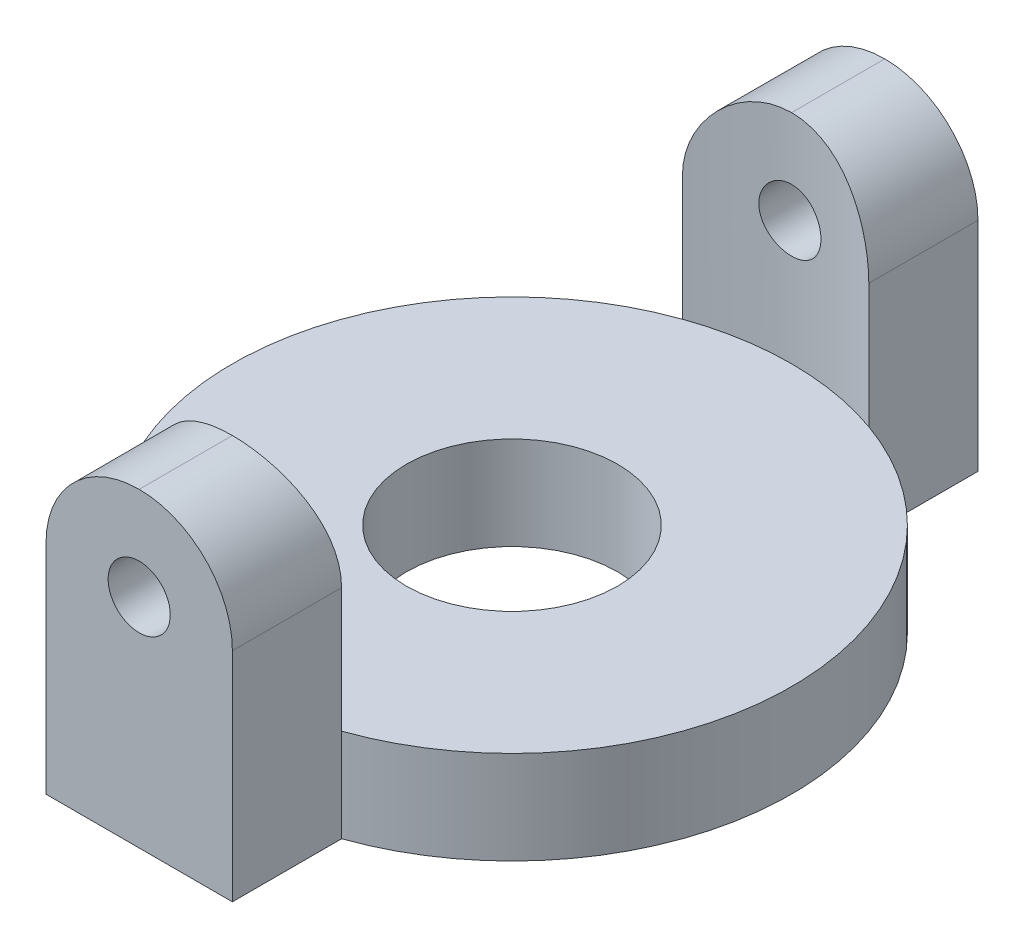
ISO-10303-21;
HEADER;
FILE_DESCRIPTION(('STEP AP214'),'2;1');
FILE_NAME('part.step','',(''),(''),'','','');
FILE_SCHEMA(('AUTOMOTIVE_DESIGN { 1 0 10303 214 1 1 1 1 }'));
ENDSEC;
DATA;
#1=APPLICATION_CONTEXT('core data for automotive mechanical design processes');
#2=APPLICATION_PROTOCOL_DEFINITION('international standard','automotive_design',2000,#1);
#3=PRODUCT_CONTEXT('',#1,'mechanical');
#4=PRODUCT('Part','Part','',(#3));
#5=PRODUCT_RELATED_PRODUCT_CATEGORY('part','',(#4));
#6=PRODUCT_DEFINITION_FORMATION('','',#4);
#7=PRODUCT_DEFINITION_CONTEXT('part definition',#1,'design');
#8=PRODUCT_DEFINITION('design','',#6,#7);
#9=PRODUCT_DEFINITION_SHAPE('','',#8);
#10=(LENGTH_UNIT() NAMED_UNIT(*) SI_UNIT(.MILLI.,.METRE.));
#11=(NAMED_UNIT(*) PLANE_ANGLE_UNIT() SI_UNIT($,.RADIAN.));
#12=(NAMED_UNIT(*) SI_UNIT($,.STERADIAN.) SOLID_ANGLE_UNIT());
#13=UNCERTAINTY_MEASURE_WITH_UNIT(LENGTH_MEASURE(1.E-05),#10,'distance_accuracy_value','');
#14=(GEOMETRIC_REPRESENTATION_CONTEXT(3) GLOBAL_UNCERTAINTY_ASSIGNED_CONTEXT((#13)) GLOBAL_UNIT_ASSIGNED_CONTEXT((#10,
#11,#12)) REPRESENTATION_CONTEXT('',''));
#15=CARTESIAN_POINT('',(0.,0.,0.));
#16=DIRECTION('',(0.,0.,1.));
#17=DIRECTION('',(1.,0.,0.));
#18=AXIS2_PLACEMENT_3D('',#15,#16,#17);
#19=CARTESIAN_POINT('',(0.,1.5,0.));
#20=DIRECTION('',(0.,-1.,0.));
#21=DIRECTION('',(0.,0.,-1.));
#22=AXIS2_PLACEMENT_3D('',#19,#20,#21);
#23=CYLINDRICAL_SURFACE('',#22,4.5);
#24=DIRECTION('',(0.,-1.,0.));
#25=VECTOR('',#24,1.);
#26=CARTESIAN_POINT('',(-1.5,5.,-4.24264068711928));
#27=LINE('',#26,#25);
#28=CARTESIAN_POINT('',(-1.5,1.5,-4.24264068711928));
#29=VERTEX_POINT('',#28);
#30=CARTESIAN_POINT('',(-1.5,0.,-4.24264068711928));
#31=VERTEX_POINT('',#30);
#32=EDGE_CURVE('E141',#29,#31,#27,.T.);
#33=ORIENTED_EDGE('',*,*,#32,.T.);
#34=CARTESIAN_POINT('',(0.,0.,0.));
#35=DIRECTION('',(0.,1.,0.));
#36=DIRECTION('',(0.,0.,1.));
#37=AXIS2_PLACEMENT_3D('',#34,#35,#36);
#38=CIRCLE('',#37,4.5);
#39=CARTESIAN_POINT('',(-1.5,0.,4.24264068711929));
#40=VERTEX_POINT('',#39);
#41=EDGE_CURVE('E123',#31,#40,#38,.T.);
#42=ORIENTED_EDGE('',*,*,#41,.T.);
#43=DIRECTION('',(0.,-1.,0.));
#44=VECTOR('',#43,1.);
#45=CARTESIAN_POINT('',(-1.5,1.5,4.24264068711929));
#46=LINE('',#45,#44);
#47=CARTESIAN_POINT('',(-1.5,1.5,4.24264068711928));
#48=VERTEX_POINT('',#47);
#49=EDGE_CURVE('E198',#48,#40,#46,.T.);
#50=ORIENTED_EDGE('',*,*,#49,.F.);
#51=CARTESIAN_POINT('',(0.,1.5,0.));
#52=DIRECTION('',(0.,1.,0.));
#53=DIRECTION('',(0.,0.,1.));
#54=AXIS2_PLACEMENT_3D('',#51,#52,#53);
#55=CIRCLE('',#54,4.5);
#56=EDGE_CURVE('E143',#29,#48,#55,.T.);
#57=ORIENTED_EDGE('',*,*,#56,.F.);
#58=EDGE_LOOP('',(#33,#42,#50,#57));
#59=FACE_BOUND('',#58,.T.);
#60=ADVANCED_FACE('F35',(#59),#23,.T.);
#61=DIRECTION('',(0.,-1.,0.));
#62=VECTOR('',#61,1.);
#63=CARTESIAN_POINT('',(1.5,5.,-4.24264068711929));
#64=LINE('',#63,#62);
#65=CARTESIAN_POINT('',(1.5,1.5,-4.24264068711928));
#66=VERTEX_POINT('',#65);
#67=CARTESIAN_POINT('',(1.5,0.,-4.24264068711928));
#68=VERTEX_POINT('',#67);
#69=EDGE_CURVE('E172',#66,#68,#64,.T.);
#70=ORIENTED_EDGE('',*,*,#69,.F.);
#71=CARTESIAN_POINT('',(1.5,1.5,4.24264068711928));
#72=VERTEX_POINT('',#71);
#73=EDGE_CURVE('E196',#72,#66,#55,.T.);
#74=ORIENTED_EDGE('',*,*,#73,.F.);
#75=DIRECTION('',(0.,-1.,0.));
#76=VECTOR('',#75,1.);
#77=CARTESIAN_POINT('',(1.5,1.5,4.24264068711928));
#78=LINE('',#77,#76);
#79=CARTESIAN_POINT('',(1.5,0.,4.24264068711929));
#80=VERTEX_POINT('',#79);
#81=EDGE_CURVE('E202',#80,#72,#78,.F.);
#82=ORIENTED_EDGE('',*,*,#81,.F.);
#83=EDGE_CURVE('E136',#80,#68,#38,.T.);
#84=ORIENTED_EDGE('',*,*,#83,.T.);
#85=EDGE_LOOP('',(#70,#74,#82,#84));
#86=FACE_BOUND('',#85,.T.);
#87=ADVANCED_FACE('F240',(#86),#23,.T.);
#88=CARTESIAN_POINT('',(0.,1.5,0.));
#89=DIRECTION('',(0.,1.,0.));
#90=DIRECTION('',(0.,0.,1.));
#91=AXIS2_PLACEMENT_3D('',#88,#89,#90);
#92=PLANE('',#91);
#93=ORIENTED_EDGE('',*,*,#73,.T.);
#94=CARTESIAN_POINT('',(0.,1.5,0.));
#95=DIRECTION('',(0.,1.,0.));
#96=DIRECTION('',(0.,0.,1.));
#97=AXIS2_PLACEMENT_3D('',#94,#95,#96);
#98=CIRCLE('',#97,4.5);
#99=EDGE_CURVE('E174',#66,#29,#98,.T.);
#100=ORIENTED_EDGE('',*,*,#99,.T.);
#101=ORIENTED_EDGE('',*,*,#56,.T.);
#102=EDGE_CURVE('E199',#48,#72,#55,.T.);
#103=ORIENTED_EDGE('',*,*,#102,.T.);
#104=EDGE_LOOP('',(#93,#100,#101,#103));
#105=FACE_BOUND('',#104,.T.);
#106=CARTESIAN_POINT('',(0.,1.5,0.));
#107=DIRECTION('',(0.,1.,0.));
#108=DIRECTION('',(0.,0.,1.));
#109=AXIS2_PLACEMENT_3D('',#106,#107,#108);
#110=CIRCLE('',#109,1.7);
#111=CARTESIAN_POINT('',(0.,1.5,1.7));
#112=VERTEX_POINT('',#111);
#113=EDGE_CURVE('E137',#112,#112,#110,.T.);
#114=ORIENTED_EDGE('',*,*,#113,.F.);
#115=EDGE_LOOP('',(#114));
#116=FACE_BOUND('',#115,.T.);
#117=ADVANCED_FACE('F237',(#105,#116),#92,.T.);
#118=CARTESIAN_POINT('',(0.,0.,0.));
#119=DIRECTION('',(0.,1.,0.));
#120=DIRECTION('',(0.,0.,1.));
#121=AXIS2_PLACEMENT_3D('',#118,#119,#120);
#122=PLANE('',#121);
#123=ORIENTED_EDGE('',*,*,#83,.F.);
#124=DIRECTION('',(0.,0.,-1.));
#125=VECTOR('',#124,1.);
#126=CARTESIAN_POINT('',(1.5,0.,4.24264068711929));
#127=LINE('',#126,#125);
#128=CARTESIAN_POINT('',(1.5,0.,5.99999999999999));
#129=VERTEX_POINT('',#128);
#130=EDGE_CURVE('E176',#129,#80,#127,.T.);
#131=ORIENTED_EDGE('',*,*,#130,.F.);
#132=DIRECTION('',(1.,0.,0.));
#133=VECTOR('',#132,1.);
#134=CARTESIAN_POINT('',(-1.5,0.,5.99999999999999));
#135=LINE('',#134,#133);
#136=CARTESIAN_POINT('',(-1.5,0.,5.99999999999999));
#137=VERTEX_POINT('',#136);
#138=EDGE_CURVE('E180',#137,#129,#135,.T.);
#139=ORIENTED_EDGE('',*,*,#138,.F.);
#140=DIRECTION('',(0.,0.,1.));
#141=VECTOR('',#140,1.);
#142=CARTESIAN_POINT('',(-1.5,0.,4.24264068711928));
#143=LINE('',#142,#141);
#144=EDGE_CURVE('E132',#40,#137,#143,.T.);
#145=ORIENTED_EDGE('',*,*,#144,.F.);
#146=ORIENTED_EDGE('',*,*,#41,.F.);
#147=DIRECTION('',(0.,0.,1.));
#148=VECTOR('',#147,1.);
#149=CARTESIAN_POINT('',(-1.5,0.,-6.));
#150=LINE('',#149,#148);
#151=CARTESIAN_POINT('',(-1.5,0.,-6.));
#152=VERTEX_POINT('',#151);
#153=EDGE_CURVE('E129',#152,#31,#150,.T.);
#154=ORIENTED_EDGE('',*,*,#153,.F.);
#155=DIRECTION('',(-1.,0.,0.));
#156=VECTOR('',#155,1.);
#157=CARTESIAN_POINT('',(-1.5,0.,-6.));
#158=LINE('',#157,#156);
#159=CARTESIAN_POINT('',(1.5,0.,-6.));
#160=VERTEX_POINT('',#159);
#161=EDGE_CURVE('E157',#160,#152,#158,.T.);
#162=ORIENTED_EDGE('',*,*,#161,.F.);
#163=DIRECTION('',(0.,0.,-1.));
#164=VECTOR('',#163,1.);
#165=CARTESIAN_POINT('',(1.5,0.,-6.));
#166=LINE('',#165,#164);
#167=EDGE_CURVE('E153',#68,#160,#166,.T.);
#168=ORIENTED_EDGE('',*,*,#167,.F.);
#169=EDGE_LOOP('',(#123,#131,#139,#145,#146,#154,#162,#168));
#170=FACE_BOUND('',#169,.T.);
#171=CARTESIAN_POINT('',(0.,0.,0.));
#172=DIRECTION('',(0.,1.,0.));
#173=DIRECTION('',(0.,0.,1.));
#174=AXIS2_PLACEMENT_3D('',#171,#172,#173);
#175=CIRCLE('',#174,1.7);
#176=CARTESIAN_POINT('',(0.,0.,1.7));
#177=VERTEX_POINT('',#176);
#178=EDGE_CURVE('E191',#177,#177,#175,.T.);
#179=ORIENTED_EDGE('',*,*,#178,.T.);
#180=EDGE_LOOP('',(#179));
#181=FACE_BOUND('',#180,.T.);
#182=ADVANCED_FACE('F125',(#170,#181),#122,.F.);
#183=CARTESIAN_POINT('',(0.,1.5,0.));
#184=DIRECTION('',(0.,-1.,0.));
#185=DIRECTION('',(0.,0.,-1.));
#186=AXIS2_PLACEMENT_3D('',#183,#184,#185);
#187=CYLINDRICAL_SURFACE('',#186,1.7);
#188=ORIENTED_EDGE('',*,*,#113,.T.);
#189=EDGE_LOOP('',(#188));
#190=FACE_BOUND('',#189,.T.);
#191=ORIENTED_EDGE('',*,*,#178,.F.);
#192=EDGE_LOOP('',(#191));
#193=FACE_BOUND('',#192,.T.);
#194=ADVANCED_FACE('F232',(#190,#193),#187,.F.);
#195=CARTESIAN_POINT('',(1.5,5.,4.24264068711929));
#196=DIRECTION('',(-1.,0.,0.));
#197=DIRECTION('',(0.,0.,1.));
#198=AXIS2_PLACEMENT_3D('',#195,#196,#197);
#199=PLANE('',#198);
#200=DIRECTION('',(0.,-1.,0.));
#201=VECTOR('',#200,1.);
#202=CARTESIAN_POINT('',(1.5,5.,4.24264068711929));
#203=LINE('',#202,#201);
#204=CARTESIAN_POINT('',(1.5,3.5,4.24264068711929));
#205=VERTEX_POINT('',#204);
#206=EDGE_CURVE('E189',#205,#72,#203,.T.);
#207=ORIENTED_EDGE('',*,*,#206,.F.);
#208=DIRECTION('',(0.,0.,-1.));
#209=VECTOR('',#208,1.);
#210=CARTESIAN_POINT('',(1.5,3.5,5.99999999999999));
#211=LINE('',#210,#209);
#212=CARTESIAN_POINT('',(1.5,3.5,5.99999999999999));
#213=VERTEX_POINT('',#212);
#214=EDGE_CURVE('E262',#205,#213,#211,.F.);
#215=ORIENTED_EDGE('',*,*,#214,.T.);
#216=DIRECTION('',(0.,-1.,0.));
#217=VECTOR('',#216,1.);
#218=CARTESIAN_POINT('',(1.5,5.,5.99999999999999));
#219=LINE('',#218,#217);
#220=EDGE_CURVE('E183',#213,#129,#219,.T.);
#221=ORIENTED_EDGE('',*,*,#220,.T.);
#222=ORIENTED_EDGE('',*,*,#130,.T.);
#223=ORIENTED_EDGE('',*,*,#81,.T.);
#224=EDGE_LOOP('',(#207,#215,#221,#222,#223));
#225=FACE_BOUND('',#224,.T.);
#226=ADVANCED_FACE('F225',(#225),#199,.F.);
#227=CARTESIAN_POINT('',(0.,5.,0.));
#228=DIRECTION('',(0.,-1.,0.));
#229=DIRECTION('',(0.,0.,-1.));
#230=AXIS2_PLACEMENT_3D('',#227,#228,#229);
#231=CYLINDRICAL_SURFACE('',#230,4.5);
#232=CARTESIAN_POINT('',(0.5,3.5,4.47213595499958));
#233=CARTESIAN_POINT('',(0.499998796258938,3.52799205673855,4.47213631683783));
#234=CARTESIAN_POINT('',(0.497641411056238,3.55600219988225,4.47240160207655));
#235=CARTESIAN_POINT('',(0.488273639283176,3.61124467202846,4.47343382673447));
#236=CARTESIAN_POINT('',(0.481258235719832,3.63847612931242,4.47420130703794));
#237=CARTESIAN_POINT('',(0.462782304707468,3.69135330951255,4.47614994074426));
#238=CARTESIAN_POINT('',(0.451324606357619,3.71700002964918,4.47733083081853));
#239=CARTESIAN_POINT('',(0.424295034963049,3.76600125782328,4.47997290658838));
#240=CARTESIAN_POINT('',(0.408723931403472,3.78935619346004,4.48143403984552));
#241=CARTESIAN_POINT('',(0.373835165529888,3.83322012454534,4.48447925761171));
#242=CARTESIAN_POINT('',(0.354502878465011,3.85371745658957,4.48606380709555));
#243=CARTESIAN_POINT('',(0.31267189050312,3.89118376347665,4.4891731161395));
#244=CARTESIAN_POINT('',(0.290173039634354,3.90815257111055,4.49069787286338));
#245=CARTESIAN_POINT('',(0.242575243977716,3.93812118565091,4.49352047185626));
#246=CARTESIAN_POINT('',(0.217469691565487,3.9511105593084,4.49481771389023));
#247=CARTESIAN_POINT('',(0.165416867879499,3.97268480904972,4.49703403548833));
#248=CARTESIAN_POINT('',(0.138469651283893,3.98126981583283,4.49795312627391));
#249=CARTESIAN_POINT('',(0.0836170021554739,3.99375712330544,4.49930631949627));
#250=CARTESIAN_POINT('',(0.0557160073898263,3.99767869794708,4.4997424176232));
#251=CARTESIAN_POINT('',(-0.000351281196377822,4.00078749932574,4.50008728893842));
#252=CARTESIAN_POINT('',(-0.028517566623086,3.99997487535469,4.49999607875526));
#253=CARTESIAN_POINT('',(-0.0841849364698929,3.99365390880449,4.4992982357037));
#254=CARTESIAN_POINT('',(-0.11168840686845,3.98816629266205,4.49869387789913));
#255=CARTESIAN_POINT('',(-0.165381568624666,3.97268345036826,4.49704023493393));
#256=CARTESIAN_POINT('',(-0.191571239534311,3.96268815408341,4.49599094285074));
#257=CARTESIAN_POINT('',(-0.241958219879531,3.93845124219583,4.49356144944717));
#258=CARTESIAN_POINT('',(-0.266151122779296,3.92420053942206,4.49218054122816));
#259=CARTESIAN_POINT('',(-0.311809742357699,3.89186394232829,4.48924257756286));
#260=CARTESIAN_POINT('',(-0.333275360149761,3.87377790900936,4.4876855157334));
#261=CARTESIAN_POINT('',(-0.372991633663294,3.83416767922821,4.48455985288442));
#262=CARTESIAN_POINT('',(-0.391224296583186,3.812625438364,4.48299123496648));
#263=CARTESIAN_POINT('',(-0.423817577261928,3.76677661882866,4.48002760605913));
#264=CARTESIAN_POINT('',(-0.438178187012795,3.7424700344406,4.47863259542877));
#265=CARTESIAN_POINT('',(-0.462620092763435,3.69176775663256,4.47617407247949));
#266=CARTESIAN_POINT('',(-0.472700139952357,3.6653714562201,4.47511065692408));
#267=CARTESIAN_POINT('',(-0.488279833034219,3.61124649606052,4.47343768863573));
#268=CARTESIAN_POINT('',(-0.493779652082501,3.58351788672321,4.47282811874526));
#269=CARTESIAN_POINT('',(-0.500019339838921,3.52767377674124,4.47213490867971));
#270=CARTESIAN_POINT('',(-0.500784442709691,3.49956112885168,4.47204848042096));
#271=CARTESIAN_POINT('',(-0.497599379775538,3.44360804324216,4.47240397596441));
#272=CARTESIAN_POINT('',(-0.493649292951552,3.41576760097054,4.47284589091669));
#273=CARTESIAN_POINT('',(-0.481167147968896,3.36122362866508,4.47420574128358));
#274=CARTESIAN_POINT('',(-0.472647141189711,3.33451730683105,4.47512242446458));
#275=CARTESIAN_POINT('',(-0.451279353497476,3.28291265720402,4.47732751023909));
#276=CARTESIAN_POINT('',(-0.438431451110153,3.2580143801826,4.47861592326608));
#277=CARTESIAN_POINT('',(-0.408709852582638,3.2106179267016,4.48142601907117));
#278=CARTESIAN_POINT('',(-0.391819507189018,3.18813024826548,4.48294865701253));
#279=CARTESIAN_POINT('',(-0.354516203482382,3.14630006569152,4.48605256984938));
#280=CARTESIAN_POINT('',(-0.334103137306587,3.12695765789448,4.48763384653916));
#281=CARTESIAN_POINT('',(-0.290224052430823,3.09187937866994,4.49068534813512));
#282=CARTESIAN_POINT('',(-0.266744791682998,3.07616001918046,4.49215504490399));
#283=CARTESIAN_POINT('',(-0.217464789909244,3.0488879357933,4.49481002019907));
#284=CARTESIAN_POINT('',(-0.191664087088226,3.03733514334041,4.49599530340481));
#285=CARTESIAN_POINT('',(-0.138530066236483,3.01875181777572,4.49794553624093));
#286=CARTESIAN_POINT('',(-0.111200207891706,3.01171149199855,4.49871139554836));
#287=CARTESIAN_POINT('',(-0.0557373001894795,3.00232102963312,4.49974024173148));
#288=CARTESIAN_POINT('',(-0.0276042791183333,2.99997072807473,4.50000324629492));
#289=CARTESIAN_POINT('',(0.0285045836242232,3.00002966593315,4.49999670989338));
#290=CARTESIAN_POINT('',(0.0564804559611491,3.00241334539354,4.49973002883372));
#291=CARTESIAN_POINT('',(0.111631579231616,3.01181875919525,4.49869974216837));
#292=CARTESIAN_POINT('',(0.138806829978736,3.0188404946165,4.49793613644699));
#293=CARTESIAN_POINT('',(0.191583769153938,3.03731521100935,4.49599748860118));
#294=CARTESIAN_POINT('',(0.21718579401922,3.04876724070593,4.49482253480677));
#295=CARTESIAN_POINT('',(0.266108479162407,3.07577479599138,4.49219179954605));
#296=CARTESIAN_POINT('',(0.289429135693031,3.09133032832034,4.49073601761846));
#297=CARTESIAN_POINT('',(0.333257974625186,3.12619872410426,4.48769707420742));
#298=CARTESIAN_POINT('',(0.353750962910306,3.14553063284926,4.48611329196913));
#299=CARTESIAN_POINT('',(0.391212708976868,3.18736433226965,4.48300200041652));
#300=CARTESIAN_POINT('',(0.408180624928168,3.2098668779834,4.48147450461556));
#301=CARTESIAN_POINT('',(0.43815353346288,3.25748079491843,4.47864371441807));
#302=CARTESIAN_POINT('',(0.451146160413467,3.28259998716446,4.47734112498709));
#303=CARTESIAN_POINT('',(0.472711119742627,3.33466285921085,4.47511595281915));
#304=CARTESIAN_POINT('',(0.481288363806246,3.36160447381737,4.47419294806205));
#305=CARTESIAN_POINT('',(0.491675607887105,3.40724446873612,4.47306063275321));
#306=CARTESIAN_POINT('',(0.494792896917113,3.42565259057992,4.47271555435831));
#307=CARTESIAN_POINT('',(0.498955488305529,3.46270446576733,4.47225309555809));
#308=CARTESIAN_POINT('',(0.500000802081688,3.48134821781191,4.47213571389803));
#309=CARTESIAN_POINT('',(0.5,3.5,4.47213595499958));
#310=B_SPLINE_CURVE_WITH_KNOTS('',3,(#232,#233,#234,#235,#236,#237,#238,#239,#240,#241,#242,
#243,#244,#245,#246,#247,#248,#249,#250,#251,#252,#253,#254,#255,#256,#257,#258,#259,#260,#261,
#262,#263,#264,#265,#266,#267,#268,#269,#270,#271,#272,#273,#274,#275,#276,#277,#278,#279,#280,
#281,#282,#283,#284,#285,#286,#287,#288,#289,#290,#291,#292,#293,#294,#295,#296,#297,#298,#299,
#300,#301,#302,#303,#304,#305,#306,#307,#308,#309),.UNSPECIFIED.,.T.,.F.,(4,2,2,2,2,2,2,2,2,2,2,
2,2,2,2,2,2,2,2,2,2,2,2,2,2,2,2,2,2,2,2,2,2,2,2,2,2,2,4),(0.,0.0839080471562434,
0.167906615733664,0.251851777012508,0.335781245971832,0.420043829838857,0.504310405813132,
0.588796056980267,0.673279200896485,0.757411949034893,0.841542044079722,0.925301080438417,
1.00906142002098,1.09300191981289,1.17694546227213,1.26134244766376,1.34573960759957,
1.4301613726663,1.51457994602667,1.59854821157639,1.68251507065048,1.76626158082215,
1.85001044176548,1.93411035443122,2.01821284262334,2.10269136332634,2.18716849398641,
2.27146167147656,2.35575188392862,2.43958822950105,2.5234245945942,2.60724296828353,
2.69106147964711,2.7753141640723,2.85958694599262,2.94411926455323,3.02855734479845,
3.08446760742393,3.14037756195152),.UNSPECIFIED.);
#311=CARTESIAN_POINT('',(0.5,3.5,4.47213595499958));
#312=VERTEX_POINT('',#311);
#313=EDGE_CURVE('E154',#312,#312,#310,.T.);
#314=ORIENTED_EDGE('',*,*,#313,.T.);
#315=EDGE_LOOP('',(#314));
#316=FACE_BOUND('',#315,.T.);
#317=CARTESIAN_POINT('',(-1.5,3.5,4.24264068711928));
#318=CARTESIAN_POINT('',(-1.50000112134656,3.54093721716919,4.24263663033288));
#319=CARTESIAN_POINT('',(-1.49832306608281,3.58185353732505,4.24323394165824));
#320=CARTESIAN_POINT('',(-1.49163781016505,3.66336872554215,4.24559012084782));
#321=CARTESIAN_POINT('',(-1.48663150863116,3.70396767634404,4.24734867500338));
#322=CARTESIAN_POINT('',(-1.46671458530407,3.82459392588194,4.25428687458707));
#323=CARTESIAN_POINT('',(-1.44690540469993,3.90377404010314,4.26112969921784));
#324=CARTESIAN_POINT('',(-1.39493809121831,4.05743641175019,4.27842096559676));
#325=CARTESIAN_POINT('',(-1.3627865487148,4.13192115166694,4.28886748280241));
#326=CARTESIAN_POINT('',(-1.28711136195107,4.27450732643787,4.3121813519221));
#327=CARTESIAN_POINT('',(-1.24358033092266,4.34260457582048,4.325050274768));
#328=CARTESIAN_POINT('',(-1.14457783238329,4.47307952106675,4.35231702831385));
#329=CARTESIAN_POINT('',(-1.08873933051181,4.5351707218686,4.36675277826479));
#330=CARTESIAN_POINT('',(-0.967483744870977,4.6493078576357,4.39520742930769));
#331=CARTESIAN_POINT('',(-0.902064728075418,4.70135176046937,4.40922624558809));
#332=CARTESIAN_POINT('',(-0.76138461349377,4.79523412904131,4.43571238785826));
#333=CARTESIAN_POINT('',(-0.685909172807705,4.83676668291543,4.44812894576878));
#334=CARTESIAN_POINT('',(-0.528583786812303,4.90640791509429,4.46955051041029));
#335=CARTESIAN_POINT('',(-0.446739935091196,4.93452924654045,4.47855873115409));
#336=CARTESIAN_POINT('',(-0.303779953731051,4.9701841273093,4.49012728845024));
#337=CARTESIAN_POINT('',(-0.243633102900633,4.98133815168233,4.49380420311035));
#338=CARTESIAN_POINT('',(-0.12233725381375,4.99625579262668,4.49875192395406));
#339=CARTESIAN_POINT('',(-0.061188298778958,5.00001972709786,4.50002283363683));
#340=CARTESIAN_POINT('',(0.,5.,4.5));
#341=B_SPLINE_CURVE_WITH_KNOTS('',3,(#317,#318,#319,#320,#321,#322,#323,#324,#325,#326,#327,
#328,#329,#330,#331,#332,#333,#334,#335,#336,#337,#338,#339,#340),.UNSPECIFIED.,.F.,.F.,(4,2,2,
2,2,2,2,2,2,2,2,4),(0.,0.122732139205529,0.245431135996246,0.48987182125998,0.734182165200974,
0.978651493847181,1.23174453983062,1.48488872202718,1.74472012780037,2.00430590199827,
2.18767805820277,2.37104232610552),.UNSPECIFIED.);
#342=CARTESIAN_POINT('',(-1.5,3.5,4.24264068711928));
#343=VERTEX_POINT('',#342);
#344=CARTESIAN_POINT('',(0.,5.,4.5));
#345=VERTEX_POINT('',#344);
#346=EDGE_CURVE('E205',#343,#345,#341,.T.);
#347=ORIENTED_EDGE('',*,*,#346,.T.);
#348=CARTESIAN_POINT('',(0.,5.,4.5));
#349=CARTESIAN_POINT('',(0.0410012723748001,5.00000095118827,4.50000303064485));
#350=CARTESIAN_POINT('',(0.0819818716020842,4.99831780221792,4.4994389660988));
#351=CARTESIAN_POINT('',(0.163629335917812,4.99161114917866,4.49720902838356));
#352=CARTESIAN_POINT('',(0.204296270874998,4.98658841209556,4.49554340820339));
#353=CARTESIAN_POINT('',(0.325150756215589,4.96660031129065,4.48895847886442));
#354=CARTESIAN_POINT('',(0.404496015911142,4.94671457420379,4.48245062230506));
#355=CARTESIAN_POINT('',(0.558498782254199,4.89452476993618,4.46588112197307));
#356=CARTESIAN_POINT('',(0.633157949406864,4.86222513082113,4.4558207454958));
#357=CARTESIAN_POINT('',(0.77603606232966,4.78620312746187,4.4331708886759));
#358=CARTESIAN_POINT('',(0.84425155277699,4.74247468150481,4.42058006260922));
#359=CARTESIAN_POINT('',(0.974610703926994,4.64326345517108,4.39371200111939));
#360=CARTESIAN_POINT('',(1.03650056134328,4.58745829460941,4.37939458490155));
#361=CARTESIAN_POINT('',(1.15024455281548,4.46635421054367,4.35090585842825));
#362=CARTESIAN_POINT('',(1.20209564072474,4.40105241589053,4.33673459375182));
#363=CARTESIAN_POINT('',(1.29575508765384,4.26049733525053,4.30969496516864));
#364=CARTESIAN_POINT('',(1.33722729576848,4.18500975932594,4.29687651595735));
#365=CARTESIAN_POINT('',(1.40675110843491,4.02766602018009,4.27462174862172));
#366=CARTESIAN_POINT('',(1.43481691224254,3.94581670227978,4.26518185480499));
#367=CARTESIAN_POINT('',(1.47033666039617,3.80300392308943,4.25304094390975));
#368=CARTESIAN_POINT('',(1.48143156288945,3.7430217254825,4.2491726329493));
#369=CARTESIAN_POINT('',(1.49627387221908,3.6220403874751,4.24395814007097));
#370=CARTESIAN_POINT('',(1.50002014455821,3.56104109151856,4.24261234758631));
#371=CARTESIAN_POINT('',(1.5,3.5,4.24264068711929));
#372=B_SPLINE_CURVE_WITH_KNOTS('',3,(#348,#349,#350,#351,#352,#353,#354,#355,#356,#357,#358,
#359,#360,#361,#362,#363,#364,#365,#366,#367,#368,#369,#370,#371),.UNSPECIFIED.,.F.,.F.,(4,2,2,
2,2,2,2,2,2,2,2,4),(0.,0.122924925323012,0.245821628865433,0.490715029998899,0.735521158078521,
0.980457823205991,1.2329880356383,1.48559475571054,1.74555232117806,2.00523394139159,
2.18812364237125,2.37104157603212),.UNSPECIFIED.);
#373=EDGE_CURVE('E211',#345,#205,#372,.T.);
#374=ORIENTED_EDGE('',*,*,#373,.T.);
#375=ORIENTED_EDGE('',*,*,#206,.T.);
#376=ORIENTED_EDGE('',*,*,#102,.F.);
#377=DIRECTION('',(0.,-1.,0.));
#378=VECTOR('',#377,1.);
#379=CARTESIAN_POINT('',(-1.5,5.,4.24264068711928));
#380=LINE('',#379,#378);
#381=EDGE_CURVE('E187',#343,#48,#380,.T.);
#382=ORIENTED_EDGE('',*,*,#381,.F.);
#383=EDGE_LOOP('',(#347,#374,#375,#376,#382));
#384=FACE_BOUND('',#383,.T.);
#385=ADVANCED_FACE('F219',(#316,#384),#231,.F.);
#386=CARTESIAN_POINT('',(-1.5,5.,4.24264068711928));
#387=DIRECTION('',(1.,0.,0.));
#388=DIRECTION('',(0.,0.,-1.));
#389=AXIS2_PLACEMENT_3D('',#386,#387,#388);
#390=PLANE('',#389);
#391=DIRECTION('',(0.,-1.,0.));
#392=VECTOR('',#391,1.);
#393=CARTESIAN_POINT('',(-1.5,5.,5.99999999999999));
#394=LINE('',#393,#392);
#395=CARTESIAN_POINT('',(-1.5,3.5,5.99999999999999));
#396=VERTEX_POINT('',#395);
#397=EDGE_CURVE('E185',#396,#137,#394,.T.);
#398=ORIENTED_EDGE('',*,*,#397,.F.);
#399=DIRECTION('',(0.,0.,1.));
#400=VECTOR('',#399,1.);
#401=CARTESIAN_POINT('',(-1.5,3.5,4.24264068711928));
#402=LINE('',#401,#400);
#403=EDGE_CURVE('E268',#396,#343,#402,.F.);
#404=ORIENTED_EDGE('',*,*,#403,.T.);
#405=ORIENTED_EDGE('',*,*,#381,.T.);
#406=ORIENTED_EDGE('',*,*,#49,.T.);
#407=ORIENTED_EDGE('',*,*,#144,.T.);
#408=EDGE_LOOP('',(#398,#404,#405,#406,#407));
#409=FACE_BOUND('',#408,.T.);
#410=ADVANCED_FACE('F224',(#409),#390,.F.);
#411=CARTESIAN_POINT('',(-1.5,5.,5.99999999999999));
#412=DIRECTION('',(0.,0.,-1.));
#413=DIRECTION('',(-1.,0.,0.));
#414=AXIS2_PLACEMENT_3D('',#411,#412,#413);
#415=PLANE('',#414);
#416=CARTESIAN_POINT('',(0.,3.5,5.99999999999999));
#417=DIRECTION('',(0.,0.,1.));
#418=DIRECTION('',(1.,0.,0.));
#419=AXIS2_PLACEMENT_3D('',#416,#417,#418);
#420=CIRCLE('',#419,0.5);
#421=CARTESIAN_POINT('',(0.5,3.5,5.99999999999999));
#422=VERTEX_POINT('',#421);
#423=EDGE_CURVE('E323',#422,#422,#420,.T.);
#424=ORIENTED_EDGE('',*,*,#423,.F.);
#425=EDGE_LOOP('',(#424));
#426=FACE_BOUND('',#425,.T.);
#427=ORIENTED_EDGE('',*,*,#220,.F.);
#428=CARTESIAN_POINT('',(0.,3.5,5.99999999999999));
#429=DIRECTION('',(0.,0.,-1.));
#430=DIRECTION('',(-1.,0.,0.));
#431=AXIS2_PLACEMENT_3D('',#428,#429,#430);
#432=CIRCLE('',#431,1.5);
#433=CARTESIAN_POINT('',(0.,5.,5.99999999999999));
#434=VERTEX_POINT('',#433);
#435=EDGE_CURVE('E259',#213,#434,#432,.F.);
#436=ORIENTED_EDGE('',*,*,#435,.T.);
#437=CARTESIAN_POINT('',(0.,3.5,5.99999999999999));
#438=DIRECTION('',(0.,0.,-1.));
#439=DIRECTION('',(-1.,0.,0.));
#440=AXIS2_PLACEMENT_3D('',#437,#438,#439);
#441=CIRCLE('',#440,1.5);
#442=EDGE_CURVE('E269',#434,#396,#441,.F.);
#443=ORIENTED_EDGE('',*,*,#442,.T.);
#444=ORIENTED_EDGE('',*,*,#397,.T.);
#445=ORIENTED_EDGE('',*,*,#138,.T.);
#446=EDGE_LOOP('',(#427,#436,#443,#444,#445));
#447=FACE_BOUND('',#446,.T.);
#448=ADVANCED_FACE('F272',(#426,#447),#415,.F.);
#449=CARTESIAN_POINT('',(-1.5,5.,-6.));
#450=DIRECTION('',(1.,0.,0.));
#451=DIRECTION('',(0.,0.,-1.));
#452=AXIS2_PLACEMENT_3D('',#449,#450,#451);
#453=PLANE('',#452);
#454=CARTESIAN_POINT('',(-1.5,3.5,-4.24264068711928));
#455=VERTEX_POINT('',#454);
#456=EDGE_CURVE('E146',#455,#29,#27,.T.);
#457=ORIENTED_EDGE('',*,*,#456,.F.);
#458=DIRECTION('',(0.,0.,1.));
#459=VECTOR('',#458,1.);
#460=CARTESIAN_POINT('',(-1.5,3.5,-6.));
#461=LINE('',#460,#459);
#462=CARTESIAN_POINT('',(-1.5,3.5,-6.));
#463=VERTEX_POINT('',#462);
#464=EDGE_CURVE('E11',#455,#463,#461,.F.);
#465=ORIENTED_EDGE('',*,*,#464,.T.);
#466=DIRECTION('',(0.,-1.,0.));
#467=VECTOR('',#466,1.);
#468=CARTESIAN_POINT('',(-1.5,5.,-6.));
#469=LINE('',#468,#467);
#470=EDGE_CURVE('E151',#463,#152,#469,.T.);
#471=ORIENTED_EDGE('',*,*,#470,.T.);
#472=ORIENTED_EDGE('',*,*,#153,.T.);
#473=ORIENTED_EDGE('',*,*,#32,.F.);
#474=EDGE_LOOP('',(#457,#465,#471,#472,#473));
#475=FACE_BOUND('',#474,.T.);
#476=ADVANCED_FACE('F149',(#475),#453,.F.);
#477=CARTESIAN_POINT('',(0.,5.,0.));
#478=DIRECTION('',(0.,-1.,0.));
#479=DIRECTION('',(0.,0.,-1.));
#480=AXIS2_PLACEMENT_3D('',#477,#478,#479);
#481=CYLINDRICAL_SURFACE('',#480,4.5);
#482=CARTESIAN_POINT('',(0.5,3.5,-4.47213595499958));
#483=CARTESIAN_POINT('',(0.499998796258938,3.47200794326145,-4.47213631683783));
#484=CARTESIAN_POINT('',(0.497641411056238,3.44399780011775,-4.47240160207655));
#485=CARTESIAN_POINT('',(0.488273639283176,3.38875532797154,-4.47343382673447));
#486=CARTESIAN_POINT('',(0.481258235719832,3.36152387068758,-4.47420130703794));
#487=CARTESIAN_POINT('',(0.462782304707469,3.30864669048745,-4.47614994074426));
#488=CARTESIAN_POINT('',(0.451324606357619,3.28299997035082,-4.47733083081853));
#489=CARTESIAN_POINT('',(0.424295034963049,3.23399874217672,-4.47997290658838));
#490=CARTESIAN_POINT('',(0.408723931403472,3.21064380653996,-4.48143403984552));
#491=CARTESIAN_POINT('',(0.373835165529888,3.16677987545467,-4.48447925761171));
#492=CARTESIAN_POINT('',(0.354502878465011,3.14628254341043,-4.48606380709555));
#493=CARTESIAN_POINT('',(0.31267189050312,3.10881623652335,-4.4891731161395));
#494=CARTESIAN_POINT('',(0.290173039634355,3.09184742888945,-4.49069787286338));
#495=CARTESIAN_POINT('',(0.242575243977716,3.06187881434909,-4.49352047185626));
#496=CARTESIAN_POINT('',(0.217469691565487,3.0488894406916,-4.49481771389023));
#497=CARTESIAN_POINT('',(0.165416867879499,3.02731519095028,-4.49703403548833));
#498=CARTESIAN_POINT('',(0.138469651283893,3.01873018416717,-4.49795312627391));
#499=CARTESIAN_POINT('',(0.0836170021554738,3.00624287669456,-4.49930631949627));
#500=CARTESIAN_POINT('',(0.0557160073898263,3.00232130205292,-4.4997424176232));
#501=CARTESIAN_POINT('',(-0.000351281196377835,2.99921250067426,-4.50008728893842));
#502=CARTESIAN_POINT('',(-0.028517566623086,3.00002512464532,-4.49999607875526));
#503=CARTESIAN_POINT('',(-0.0841849364698931,3.00634609119552,-4.4992982357037));
#504=CARTESIAN_POINT('',(-0.111688406868451,3.01183370733794,-4.49869387789913));
#505=CARTESIAN_POINT('',(-0.165381568624666,3.02731654963174,-4.49704023493393));
#506=CARTESIAN_POINT('',(-0.191571239534311,3.03731184591659,-4.49599094285074));
#507=CARTESIAN_POINT('',(-0.241958219879531,3.06154875780417,-4.49356144944717));
#508=CARTESIAN_POINT('',(-0.266151122779296,3.07579946057794,-4.49218054122816));
#509=CARTESIAN_POINT('',(-0.311809742357699,3.10813605767171,-4.48924257756286));
#510=CARTESIAN_POINT('',(-0.333275360149761,3.12622209099064,-4.4876855157334));
#511=CARTESIAN_POINT('',(-0.372991633663294,3.16583232077179,-4.48455985288442));
#512=CARTESIAN_POINT('',(-0.391224296583186,3.187374561636,-4.48299123496648));
#513=CARTESIAN_POINT('',(-0.423817577261928,3.23322338117134,-4.48002760605913));
#514=CARTESIAN_POINT('',(-0.438178187012795,3.2575299655594,-4.47863259542877));
#515=CARTESIAN_POINT('',(-0.462620092763435,3.30823224336744,-4.47617407247949));
#516=CARTESIAN_POINT('',(-0.472700139952357,3.3346285437799,-4.47511065692408));
#517=CARTESIAN_POINT('',(-0.488279833034219,3.38875350393948,-4.47343768863573));
#518=CARTESIAN_POINT('',(-0.493779652082501,3.41648211327679,-4.47282811874526));
#519=CARTESIAN_POINT('',(-0.500019339838921,3.47232622325876,-4.47213490867971));
#520=CARTESIAN_POINT('',(-0.500784442709691,3.50043887114832,-4.47204848042096));
#521=CARTESIAN_POINT('',(-0.497599379775538,3.55639195675784,-4.47240397596441));
#522=CARTESIAN_POINT('',(-0.493649292951552,3.58423239902946,-4.47284589091669));
#523=CARTESIAN_POINT('',(-0.481167147968896,3.63877637133492,-4.47420574128358));
#524=CARTESIAN_POINT('',(-0.472647141189711,3.66548269316895,-4.47512242446458));
#525=CARTESIAN_POINT('',(-0.451279353497476,3.71708734279598,-4.47732751023909));
#526=CARTESIAN_POINT('',(-0.438431451110152,3.7419856198174,-4.47861592326608));
#527=CARTESIAN_POINT('',(-0.408709852582638,3.7893820732984,-4.48142601907117));
#528=CARTESIAN_POINT('',(-0.391819507189017,3.81186975173452,-4.48294865701253));
#529=CARTESIAN_POINT('',(-0.354516203482382,3.85369993430848,-4.48605256984938));
#530=CARTESIAN_POINT('',(-0.334103137306587,3.87304234210552,-4.48763384653916));
#531=CARTESIAN_POINT('',(-0.290224052430823,3.90812062133006,-4.49068534813512));
#532=CARTESIAN_POINT('',(-0.266744791682998,3.92383998081954,-4.49215504490399));
#533=CARTESIAN_POINT('',(-0.217464789909244,3.9511120642067,-4.49481002019907));
#534=CARTESIAN_POINT('',(-0.191664087088225,3.96266485665959,-4.49599530340481));
#535=CARTESIAN_POINT('',(-0.138530066236483,3.98124818222429,-4.49794553624093));
#536=CARTESIAN_POINT('',(-0.111200207891706,3.98828850800145,-4.49871139554836));
#537=CARTESIAN_POINT('',(-0.0557373001894793,3.99767897036688,-4.49974024173148));
#538=CARTESIAN_POINT('',(-0.0276042791183331,4.00002927192527,-4.50000324629492));
#539=CARTESIAN_POINT('',(0.0285045836242234,3.99997033406685,-4.49999670989338));
#540=CARTESIAN_POINT('',(0.0564804559611494,3.99758665460646,-4.49973002883372));
#541=CARTESIAN_POINT('',(0.111631579231616,3.98818124080475,-4.49869974216837));
#542=CARTESIAN_POINT('',(0.138806829978737,3.9811595053835,-4.49793613644699));
#543=CARTESIAN_POINT('',(0.191583769153938,3.96268478899065,-4.49599748860118));
#544=CARTESIAN_POINT('',(0.21718579401922,3.95123275929407,-4.49482253480677));
#545=CARTESIAN_POINT('',(0.266108479162407,3.92422520400862,-4.49219179954605));
#546=CARTESIAN_POINT('',(0.289429135693031,3.90866967167966,-4.49073601761846));
#547=CARTESIAN_POINT('',(0.333257974625187,3.87380127589574,-4.48769707420742));
#548=CARTESIAN_POINT('',(0.353750962910307,3.85446936715074,-4.48611329196913));
#549=CARTESIAN_POINT('',(0.391212708976868,3.81263566773035,-4.48300200041652));
#550=CARTESIAN_POINT('',(0.408180624928168,3.7901331220166,-4.48147450461556));
#551=CARTESIAN_POINT('',(0.438153533462881,3.74251920508157,-4.47864371441808));
#552=CARTESIAN_POINT('',(0.451146160413467,3.71740001283554,-4.47734112498709));
#553=CARTESIAN_POINT('',(0.472711119742627,3.66533714078915,-4.47511595281915));
#554=CARTESIAN_POINT('',(0.481288363806246,3.63839552618263,-4.47419294806205));
#555=CARTESIAN_POINT('',(0.491675607887105,3.59275553126388,-4.47306063275321));
#556=CARTESIAN_POINT('',(0.494792896917113,3.57434740942008,-4.47271555435831));
#557=CARTESIAN_POINT('',(0.498955488305529,3.53729553423267,-4.47225309555809));
#558=CARTESIAN_POINT('',(0.500000802081688,3.51865178218809,-4.47213571389803));
#559=CARTESIAN_POINT('',(0.5,3.5,-4.47213595499958));
#560=B_SPLINE_CURVE_WITH_KNOTS('',3,(#482,#483,#484,#485,#486,#487,#488,#489,#490,#491,#492,
#493,#494,#495,#496,#497,#498,#499,#500,#501,#502,#503,#504,#505,#506,#507,#508,#509,#510,#511,
#512,#513,#514,#515,#516,#517,#518,#519,#520,#521,#522,#523,#524,#525,#526,#527,#528,#529,#530,
#531,#532,#533,#534,#535,#536,#537,#538,#539,#540,#541,#542,#543,#544,#545,#546,#547,#548,#549,
#550,#551,#552,#553,#554,#555,#556,#557,#558,#559),.UNSPECIFIED.,.T.,.F.,(4,2,2,2,2,2,2,2,2,2,2,
2,2,2,2,2,2,2,2,2,2,2,2,2,2,2,2,2,2,2,2,2,2,2,2,2,2,2,4),(0.,0.0839080471562434,
0.167906615733664,0.251851777012507,0.335781245971832,0.420043829838856,0.504310405813132,
0.588796056980267,0.673279200896484,0.757411949034893,0.841542044079722,0.925301080438417,
1.00906142002098,1.09300191981289,1.17694546227213,1.26134244766376,1.34573960759957,
1.4301613726663,1.51457994602667,1.59854821157639,1.68251507065048,1.76626158082215,
1.85001044176548,1.93411035443122,2.01821284262334,2.10269136332634,2.18716849398641,
2.27146167147656,2.35575188392862,2.43958822950105,2.5234245945942,2.60724296828353,
2.69106147964711,2.7753141640723,2.85958694599262,2.94411926455323,3.02855734479845,
3.08446760742393,3.14037756195152),.UNSPECIFIED.);
#561=CARTESIAN_POINT('',(0.5,3.5,-4.47213595499958));
#562=VERTEX_POINT('',#561);
#563=EDGE_CURVE('E160',#562,#562,#560,.T.);
#564=ORIENTED_EDGE('',*,*,#563,.T.);
#565=EDGE_LOOP('',(#564));
#566=FACE_BOUND('',#565,.T.);
#567=CARTESIAN_POINT('',(1.5,3.5,-4.24264068711929));
#568=VERTEX_POINT('',#567);
#569=EDGE_CURVE('E147',#568,#66,#64,.T.);
#570=ORIENTED_EDGE('',*,*,#569,.F.);
#571=CARTESIAN_POINT('',(1.5,3.5,-4.24264068711929));
#572=CARTESIAN_POINT('',(1.50000112134656,3.54093721716919,-4.24263663033288));
#573=CARTESIAN_POINT('',(1.49832306608281,3.58185353732505,-4.24323394165824));
#574=CARTESIAN_POINT('',(1.49163781016505,3.66336872554215,-4.24559012084782));
#575=CARTESIAN_POINT('',(1.48663150863116,3.70396767634404,-4.24734867500338));
#576=CARTESIAN_POINT('',(1.46671458530407,3.82459392588194,-4.25428687458707));
#577=CARTESIAN_POINT('',(1.44690540469993,3.90377404010314,-4.26112969921784));
#578=CARTESIAN_POINT('',(1.39493809121831,4.05743641175019,-4.27842096559676));
#579=CARTESIAN_POINT('',(1.3627865487148,4.13192115166694,-4.28886748280241));
#580=CARTESIAN_POINT('',(1.28711136195107,4.27450732643787,-4.3121813519221));
#581=CARTESIAN_POINT('',(1.24358033092267,4.34260457582048,-4.32505027476801));
#582=CARTESIAN_POINT('',(1.14457783238329,4.47307952106675,-4.35231702831385));
#583=CARTESIAN_POINT('',(1.08873933051181,4.5351707218686,-4.36675277826479));
#584=CARTESIAN_POINT('',(0.967483744870978,4.6493078576357,-4.3952074293077));
#585=CARTESIAN_POINT('',(0.90206472807542,4.70135176046937,-4.40922624558809));
#586=CARTESIAN_POINT('',(0.761384613493772,4.79523412904131,-4.43571238785826));
#587=CARTESIAN_POINT('',(0.685909172807707,4.83676668291543,-4.44812894576878));
#588=CARTESIAN_POINT('',(0.528583786812306,4.90640791509429,-4.46955051041029));
#589=CARTESIAN_POINT('',(0.446739935091199,4.93452924654045,-4.47855873115409));
#590=CARTESIAN_POINT('',(0.303779953731053,4.9701841273093,-4.49012728845024));
#591=CARTESIAN_POINT('',(0.243633102900635,4.98133815168233,-4.49380420311035));
#592=CARTESIAN_POINT('',(0.122337253813752,4.99625579262668,-4.49875192395406));
#593=CARTESIAN_POINT('',(0.0611882987789597,5.00001972709786,-4.50002283363683));
#594=CARTESIAN_POINT('',(0.,5.,-4.5));
#595=B_SPLINE_CURVE_WITH_KNOTS('',3,(#571,#572,#573,#574,#575,#576,#577,#578,#579,#580,#581,
#582,#583,#584,#585,#586,#587,#588,#589,#590,#591,#592,#593,#594),.UNSPECIFIED.,.F.,.F.,(4,2,2,
2,2,2,2,2,2,2,2,4),(0.,0.122732139205528,0.245431135996246,0.48987182125998,0.734182165200974,
0.978651493847181,1.23174453983062,1.48488872202718,1.74472012780037,2.00430590199827,
2.18767805820277,2.37104232610552),.UNSPECIFIED.);
#596=CARTESIAN_POINT('',(0.,5.,-4.5));
#597=VERTEX_POINT('',#596);
#598=EDGE_CURVE('E45',#568,#597,#595,.T.);
#599=ORIENTED_EDGE('',*,*,#598,.T.);
#600=CARTESIAN_POINT('',(0.,5.,-4.5));
#601=CARTESIAN_POINT('',(-0.041001272374798,5.00000095118827,-4.50000303064485));
#602=CARTESIAN_POINT('',(-0.0819818716020821,4.99831780221792,-4.4994389660988));
#603=CARTESIAN_POINT('',(-0.16362933591781,4.99161114917866,-4.49720902838356));
#604=CARTESIAN_POINT('',(-0.204296270874996,4.98658841209556,-4.49554340820339));
#605=CARTESIAN_POINT('',(-0.325150756215587,4.96660031129065,-4.48895847886442));
#606=CARTESIAN_POINT('',(-0.40449601591114,4.94671457420379,-4.48245062230506));
#607=CARTESIAN_POINT('',(-0.558498782254197,4.89452476993618,-4.46588112197307));
#608=CARTESIAN_POINT('',(-0.633157949406862,4.86222513082113,-4.4558207454958));
#609=CARTESIAN_POINT('',(-0.776036062329658,4.78620312746187,-4.4331708886759));
#610=CARTESIAN_POINT('',(-0.844251552776988,4.74247468150481,-4.42058006260922));
#611=CARTESIAN_POINT('',(-0.974610703926992,4.64326345517108,-4.39371200111939));
#612=CARTESIAN_POINT('',(-1.03650056134328,4.58745829460941,-4.37939458490155));
#613=CARTESIAN_POINT('',(-1.15024455281548,4.46635421054367,-4.35090585842825));
#614=CARTESIAN_POINT('',(-1.20209564072474,4.40105241589053,-4.33673459375182));
#615=CARTESIAN_POINT('',(-1.29575508765383,4.26049733525053,-4.30969496516864));
#616=CARTESIAN_POINT('',(-1.33722729576847,4.18500975932594,-4.29687651595735));
#617=CARTESIAN_POINT('',(-1.40675110843491,4.02766602018009,-4.27462174862172));
#618=CARTESIAN_POINT('',(-1.43481691224253,3.94581670227978,-4.26518185480499));
#619=CARTESIAN_POINT('',(-1.47033666039617,3.80300392308943,-4.25304094390975));
#620=CARTESIAN_POINT('',(-1.48143156288945,3.7430217254825,-4.2491726329493));
#621=CARTESIAN_POINT('',(-1.49627387221908,3.6220403874751,-4.24395814007097));
#622=CARTESIAN_POINT('',(-1.50002014455821,3.56104109151856,-4.24261234758631));
#623=CARTESIAN_POINT('',(-1.5,3.5,-4.24264068711928));
#624=B_SPLINE_CURVE_WITH_KNOTS('',3,(#600,#601,#602,#603,#604,#605,#606,#607,#608,#609,#610,
#611,#612,#613,#614,#615,#616,#617,#618,#619,#620,#621,#622,#623),.UNSPECIFIED.,.F.,.F.,(4,2,2,
2,2,2,2,2,2,2,2,4),(0.,0.122924925323012,0.245821628865433,0.490715029998899,0.735521158078521,
0.980457823205991,1.2329880356383,1.48559475571054,1.74555232117806,2.00523394139159,
2.18812364237125,2.37104157603212),.UNSPECIFIED.);
#625=EDGE_CURVE('E53',#597,#455,#624,.T.);
#626=ORIENTED_EDGE('',*,*,#625,.T.);
#627=ORIENTED_EDGE('',*,*,#456,.T.);
#628=ORIENTED_EDGE('',*,*,#99,.F.);
#629=EDGE_LOOP('',(#570,#599,#626,#627,#628));
#630=FACE_BOUND('',#629,.T.);
#631=ADVANCED_FACE('F285',(#566,#630),#481,.F.);
#632=CARTESIAN_POINT('',(1.5,5.,-6.));
#633=DIRECTION('',(-1.,0.,0.));
#634=DIRECTION('',(0.,0.,1.));
#635=AXIS2_PLACEMENT_3D('',#632,#633,#634);
#636=PLANE('',#635);
#637=DIRECTION('',(0.,-1.,0.));
#638=VECTOR('',#637,1.);
#639=CARTESIAN_POINT('',(1.5,5.,-6.));
#640=LINE('',#639,#638);
#641=CARTESIAN_POINT('',(1.5,3.5,-6.));
#642=VERTEX_POINT('',#641);
#643=EDGE_CURVE('E170',#642,#160,#640,.T.);
#644=ORIENTED_EDGE('',*,*,#643,.F.);
#645=DIRECTION('',(0.,0.,-1.));
#646=VECTOR('',#645,1.);
#647=CARTESIAN_POINT('',(1.5,3.5,-6.));
#648=LINE('',#647,#646);
#649=EDGE_CURVE('E295',#642,#568,#648,.F.);
#650=ORIENTED_EDGE('',*,*,#649,.T.);
#651=ORIENTED_EDGE('',*,*,#569,.T.);
#652=ORIENTED_EDGE('',*,*,#69,.T.);
#653=ORIENTED_EDGE('',*,*,#167,.T.);
#654=EDGE_LOOP('',(#644,#650,#651,#652,#653));
#655=FACE_BOUND('',#654,.T.);
#656=ADVANCED_FACE('F313',(#655),#636,.F.);
#657=CARTESIAN_POINT('',(-1.5,5.,-6.));
#658=DIRECTION('',(0.,0.,1.));
#659=DIRECTION('',(1.,0.,0.));
#660=AXIS2_PLACEMENT_3D('',#657,#658,#659);
#661=PLANE('',#660);
#662=CARTESIAN_POINT('',(0.,3.5,-6.));
#663=DIRECTION('',(0.,0.,1.));
#664=DIRECTION('',(1.,0.,0.));
#665=AXIS2_PLACEMENT_3D('',#662,#663,#664);
#666=CIRCLE('',#665,0.5);
#667=CARTESIAN_POINT('',(0.5,3.5,-6.));
#668=VERTEX_POINT('',#667);
#669=EDGE_CURVE('E322',#668,#668,#666,.T.);
#670=ORIENTED_EDGE('',*,*,#669,.T.);
#671=EDGE_LOOP('',(#670));
#672=FACE_BOUND('',#671,.T.);
#673=CARTESIAN_POINT('',(0.,3.5,-6.));
#674=DIRECTION('',(0.,0.,1.));
#675=DIRECTION('',(1.,0.,0.));
#676=AXIS2_PLACEMENT_3D('',#673,#674,#675);
#677=CIRCLE('',#676,1.5);
#678=CARTESIAN_POINT('',(0.,5.,-6.));
#679=VERTEX_POINT('',#678);
#680=EDGE_CURVE('E290',#463,#679,#677,.F.);
#681=ORIENTED_EDGE('',*,*,#680,.T.);
#682=CARTESIAN_POINT('',(0.,3.5,-6.));
#683=DIRECTION('',(0.,0.,1.));
#684=DIRECTION('',(1.,0.,0.));
#685=AXIS2_PLACEMENT_3D('',#682,#683,#684);
#686=CIRCLE('',#685,1.5);
#687=EDGE_CURVE('E293',#679,#642,#686,.F.);
#688=ORIENTED_EDGE('',*,*,#687,.T.);
#689=ORIENTED_EDGE('',*,*,#643,.T.);
#690=ORIENTED_EDGE('',*,*,#161,.T.);
#691=ORIENTED_EDGE('',*,*,#470,.F.);
#692=EDGE_LOOP('',(#681,#688,#689,#690,#691));
#693=FACE_BOUND('',#692,.T.);
#694=ADVANCED_FACE('F329',(#672,#693),#661,.F.);
#695=CARTESIAN_POINT('',(0.,3.5,-6.));
#696=DIRECTION('',(0.,0.,1.));
#697=DIRECTION('',(1.,0.,0.));
#698=AXIS2_PLACEMENT_3D('',#695,#696,#697);
#699=CYLINDRICAL_SURFACE('',#698,0.5);
#700=ORIENTED_EDGE('',*,*,#669,.F.);
#701=EDGE_LOOP('',(#700));
#702=FACE_BOUND('',#701,.T.);
#703=ORIENTED_EDGE('',*,*,#563,.F.);
#704=EDGE_LOOP('',(#703));
#705=FACE_BOUND('',#704,.T.);
#706=ADVANCED_FACE('F327',(#702,#705),#699,.F.);
#707=ORIENTED_EDGE('',*,*,#423,.T.);
#708=EDGE_LOOP('',(#707));
#709=FACE_BOUND('',#708,.T.);
#710=ORIENTED_EDGE('',*,*,#313,.F.);
#711=EDGE_LOOP('',(#710));
#712=FACE_BOUND('',#711,.T.);
#713=ADVANCED_FACE('F255',(#709,#712),#699,.F.);
#714=CARTESIAN_POINT('',(0.,3.5,0.));
#715=DIRECTION('',(0.,0.,-1.));
#716=DIRECTION('',(-1.,0.,0.));
#717=AXIS2_PLACEMENT_3D('',#714,#715,#716);
#718=CYLINDRICAL_SURFACE('',#717,1.5);
#719=ORIENTED_EDGE('',*,*,#403,.F.);
#720=ORIENTED_EDGE('',*,*,#442,.F.);
#721=DIRECTION('',(0.,0.,1.));
#722=VECTOR('',#721,1.);
#723=CARTESIAN_POINT('',(0.,5.,5.99999999999999));
#724=LINE('',#723,#722);
#725=EDGE_CURVE('E264',#345,#434,#724,.T.);
#726=ORIENTED_EDGE('',*,*,#725,.F.);
#727=ORIENTED_EDGE('',*,*,#346,.F.);
#728=EDGE_LOOP('',(#719,#720,#726,#727));
#729=FACE_BOUND('',#728,.T.);
#730=ADVANCED_FACE('F217',(#729),#718,.T.);
#731=CARTESIAN_POINT('',(0.,3.5,0.));
#732=DIRECTION('',(0.,0.,1.));
#733=DIRECTION('',(1.,0.,0.));
#734=AXIS2_PLACEMENT_3D('',#731,#732,#733);
#735=CYLINDRICAL_SURFACE('',#734,1.5);
#736=ORIENTED_EDGE('',*,*,#435,.F.);
#737=ORIENTED_EDGE('',*,*,#214,.F.);
#738=ORIENTED_EDGE('',*,*,#373,.F.);
#739=ORIENTED_EDGE('',*,*,#725,.T.);
#740=EDGE_LOOP('',(#736,#737,#738,#739));
#741=FACE_BOUND('',#740,.T.);
#742=ADVANCED_FACE('F245',(#741),#735,.T.);
#743=CARTESIAN_POINT('',(0.,3.5,0.));
#744=DIRECTION('',(0.,0.,1.));
#745=DIRECTION('',(1.,0.,0.));
#746=AXIS2_PLACEMENT_3D('',#743,#744,#745);
#747=CYLINDRICAL_SURFACE('',#746,1.5);
#748=ORIENTED_EDGE('',*,*,#464,.F.);
#749=ORIENTED_EDGE('',*,*,#625,.F.);
#750=DIRECTION('',(0.,0.,1.));
#751=VECTOR('',#750,1.);
#752=CARTESIAN_POINT('',(0.,5.,0.));
#753=LINE('',#752,#751);
#754=EDGE_CURVE('E40',#679,#597,#753,.T.);
#755=ORIENTED_EDGE('',*,*,#754,.F.);
#756=ORIENTED_EDGE('',*,*,#680,.F.);
#757=EDGE_LOOP('',(#748,#749,#755,#756));
#758=FACE_BOUND('',#757,.T.);
#759=ADVANCED_FACE('F37',(#758),#747,.T.);
#760=CARTESIAN_POINT('',(0.,3.5,0.));
#761=DIRECTION('',(0.,0.,-1.));
#762=DIRECTION('',(-1.,0.,0.));
#763=AXIS2_PLACEMENT_3D('',#760,#761,#762);
#764=CYLINDRICAL_SURFACE('',#763,1.5);
#765=ORIENTED_EDGE('',*,*,#598,.F.);
#766=ORIENTED_EDGE('',*,*,#649,.F.);
#767=ORIENTED_EDGE('',*,*,#687,.F.);
#768=ORIENTED_EDGE('',*,*,#754,.T.);
#769=EDGE_LOOP('',(#765,#766,#767,#768));
#770=FACE_BOUND('',#769,.T.);
#771=ADVANCED_FACE('F253',(#770),#764,.T.);
#772=CLOSED_SHELL('',(#60,#87,#117,#182,#194,#226,#385,#410,#448,#476,#631,#656,#694,#706,#713,
#730,#742,#759,#771));
#773=MANIFOLD_SOLID_BREP('B2',#772);
#774=ADVANCED_BREP_SHAPE_REPRESENTATION('',(#18,#773),#14);
#775=SHAPE_DEFINITION_REPRESENTATION(#9,#774);
ENDSEC;
END-ISO-10303-21;
